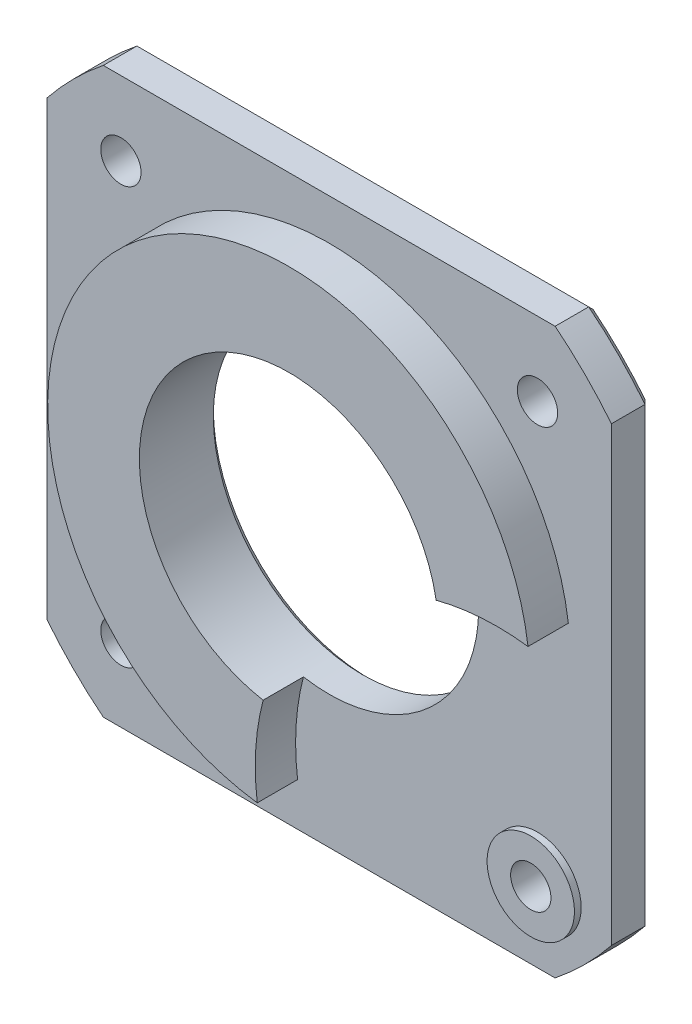
ISO-10303-21;
HEADER;
FILE_DESCRIPTION(('STEP AP214'),'2;1');
FILE_NAME('part.step','',(''),(''),'','','');
FILE_SCHEMA(('AUTOMOTIVE_DESIGN { 1 0 10303 214 1 1 1 1 }'));
ENDSEC;
DATA;
#1=APPLICATION_CONTEXT('core data for automotive mechanical design processes');
#2=APPLICATION_PROTOCOL_DEFINITION('international standard','automotive_design',2000,#1);
#3=PRODUCT_CONTEXT('',#1,'mechanical');
#4=PRODUCT('Part','Part','',(#3));
#5=PRODUCT_RELATED_PRODUCT_CATEGORY('part','',(#4));
#6=PRODUCT_DEFINITION_FORMATION('','',#4);
#7=PRODUCT_DEFINITION_CONTEXT('part definition',#1,'design');
#8=PRODUCT_DEFINITION('design','',#6,#7);
#9=PRODUCT_DEFINITION_SHAPE('','',#8);
#10=(LENGTH_UNIT() NAMED_UNIT(*) SI_UNIT(.MILLI.,.METRE.));
#11=(NAMED_UNIT(*) PLANE_ANGLE_UNIT() SI_UNIT($,.RADIAN.));
#12=(NAMED_UNIT(*) SI_UNIT($,.STERADIAN.) SOLID_ANGLE_UNIT());
#13=UNCERTAINTY_MEASURE_WITH_UNIT(LENGTH_MEASURE(1.E-05),#10,'distance_accuracy_value','');
#14=(GEOMETRIC_REPRESENTATION_CONTEXT(3) GLOBAL_UNCERTAINTY_ASSIGNED_CONTEXT((#13)) GLOBAL_UNIT_ASSIGNED_CONTEXT((#10,
#11,#12)) REPRESENTATION_CONTEXT('',''));
#15=CARTESIAN_POINT('',(0.,0.,0.));
#16=DIRECTION('',(0.,0.,1.));
#17=DIRECTION('',(1.,0.,0.));
#18=AXIS2_PLACEMENT_3D('',#15,#16,#17);
#19=CARTESIAN_POINT('',(15.5,-15.4999999999995,0.));
#20=DIRECTION('',(0.,0.,1.));
#21=DIRECTION('',(0.,-1.,0.));
#22=AXIS2_PLACEMENT_3D('',#19,#20,#21);
#23=CYLINDRICAL_SURFACE('',#22,1.5);
#24=CARTESIAN_POINT('',(15.5,-15.4999999999995,3.5));
#25=DIRECTION('',(0.,0.,-1.));
#26=DIRECTION('',(1.,0.,0.));
#27=AXIS2_PLACEMENT_3D('',#24,#25,#26);
#28=CIRCLE('',#27,1.5);
#29=CARTESIAN_POINT('',(15.5,-16.9999999999995,3.5));
#30=VERTEX_POINT('',#29);
#31=EDGE_CURVE('E27',#30,#30,#28,.T.);
#32=ORIENTED_EDGE('',*,*,#31,.F.);
#33=EDGE_LOOP('',(#32));
#34=FACE_BOUND('',#33,.T.);
#35=CARTESIAN_POINT('',(15.5,-15.4999999999995,0.5));
#36=DIRECTION('',(0.,0.,1.));
#37=DIRECTION('',(0.,-1.,0.));
#38=AXIS2_PLACEMENT_3D('',#35,#36,#37);
#39=CIRCLE('',#38,1.5);
#40=CARTESIAN_POINT('',(15.5,-16.9999999999995,0.5));
#41=VERTEX_POINT('',#40);
#42=EDGE_CURVE('E10',#41,#41,#39,.T.);
#43=ORIENTED_EDGE('',*,*,#42,.F.);
#44=EDGE_LOOP('',(#43));
#45=FACE_BOUND('',#44,.T.);
#46=ADVANCED_FACE('F16',(#34,#45),#23,.F.);
#47=CARTESIAN_POINT('',(15.5,-15.4999999999995,0.25));
#48=DIRECTION('',(0.,0.,-1.));
#49=DIRECTION('',(0.,1.,0.));
#50=AXIS2_PLACEMENT_3D('',#47,#48,#49);
#51=CONICAL_SURFACE('',#50,1.75,0.785398163397448);
#52=ORIENTED_EDGE('',*,*,#42,.T.);
#53=EDGE_LOOP('',(#52));
#54=FACE_BOUND('',#53,.T.);
#55=CARTESIAN_POINT('',(15.5,-15.4999999999995,0.));
#56=DIRECTION('',(0.,0.,1.));
#57=DIRECTION('',(0.,-1.,0.));
#58=AXIS2_PLACEMENT_3D('',#55,#56,#57);
#59=CIRCLE('',#58,2.);
#60=CARTESIAN_POINT('',(15.5,-17.4999999999995,0.));
#61=VERTEX_POINT('',#60);
#62=EDGE_CURVE('E289',#61,#61,#59,.T.);
#63=ORIENTED_EDGE('',*,*,#62,.F.);
#64=EDGE_LOOP('',(#63));
#65=FACE_BOUND('',#64,.T.);
#66=ADVANCED_FACE('F565',(#54,#65),#51,.F.);
#67=CARTESIAN_POINT('',(0.,0.,3.5));
#68=DIRECTION('',(0.,0.,1.));
#69=DIRECTION('',(1.,0.,0.));
#70=AXIS2_PLACEMENT_3D('',#67,#68,#69);
#71=PLANE('',#70);
#72=ORIENTED_EDGE('',*,*,#31,.T.);
#73=EDGE_LOOP('',(#72));
#74=FACE_BOUND('',#73,.T.);
#75=CARTESIAN_POINT('',(15.5,-15.4999999999995,3.5));
#76=DIRECTION('',(0.,0.,1.));
#77=DIRECTION('',(1.,0.,0.));
#78=AXIS2_PLACEMENT_3D('',#75,#76,#77);
#79=CIRCLE('',#78,3.25);
#80=CARTESIAN_POINT('',(18.75,-15.4999999999995,3.5));
#81=VERTEX_POINT('',#80);
#82=EDGE_CURVE('E342',#81,#81,#79,.T.);
#83=ORIENTED_EDGE('',*,*,#82,.T.);
#84=EDGE_LOOP('',(#83));
#85=FACE_BOUND('',#84,.T.);
#86=ADVANCED_FACE('F571',(#74,#85),#71,.T.);
#87=CARTESIAN_POINT('',(-15.5,15.4999999999995,0.25));
#88=DIRECTION('',(0.,0.,-1.));
#89=DIRECTION('',(0.,1.,0.));
#90=AXIS2_PLACEMENT_3D('',#87,#88,#89);
#91=CONICAL_SURFACE('',#90,1.75,0.785398163397448);
#92=CARTESIAN_POINT('',(-15.5,15.4999999999995,0.5));
#93=DIRECTION('',(0.,0.,1.));
#94=DIRECTION('',(0.,-1.,0.));
#95=AXIS2_PLACEMENT_3D('',#92,#93,#94);
#96=CIRCLE('',#95,1.5);
#97=CARTESIAN_POINT('',(-15.5,13.9999999999995,0.5));
#98=VERTEX_POINT('',#97);
#99=EDGE_CURVE('E293',#98,#98,#96,.T.);
#100=ORIENTED_EDGE('',*,*,#99,.T.);
#101=EDGE_LOOP('',(#100));
#102=FACE_BOUND('',#101,.T.);
#103=CARTESIAN_POINT('',(-15.5,15.4999999999995,0.));
#104=DIRECTION('',(0.,0.,1.));
#105=DIRECTION('',(0.,-1.,0.));
#106=AXIS2_PLACEMENT_3D('',#103,#104,#105);
#107=CIRCLE('',#106,2.);
#108=CARTESIAN_POINT('',(-15.5,13.4999999999995,0.));
#109=VERTEX_POINT('',#108);
#110=EDGE_CURVE('E295',#109,#109,#107,.T.);
#111=ORIENTED_EDGE('',*,*,#110,.F.);
#112=EDGE_LOOP('',(#111));
#113=FACE_BOUND('',#112,.T.);
#114=ADVANCED_FACE('F601',(#102,#113),#91,.F.);
#115=CARTESIAN_POINT('',(15.5,15.5,0.25));
#116=DIRECTION('',(0.,0.,-1.));
#117=DIRECTION('',(0.,1.,0.));
#118=AXIS2_PLACEMENT_3D('',#115,#116,#117);
#119=CONICAL_SURFACE('',#118,1.75,0.785398163397448);
#120=CARTESIAN_POINT('',(15.5,15.5,0.5));
#121=DIRECTION('',(0.,0.,1.));
#122=DIRECTION('',(0.,-1.,0.));
#123=AXIS2_PLACEMENT_3D('',#120,#121,#122);
#124=CIRCLE('',#123,1.5);
#125=CARTESIAN_POINT('',(15.5,14.,0.5));
#126=VERTEX_POINT('',#125);
#127=EDGE_CURVE('E290',#126,#126,#124,.T.);
#128=ORIENTED_EDGE('',*,*,#127,.T.);
#129=EDGE_LOOP('',(#128));
#130=FACE_BOUND('',#129,.T.);
#131=CARTESIAN_POINT('',(15.5,15.5,0.));
#132=DIRECTION('',(0.,0.,1.));
#133=DIRECTION('',(0.,-1.,0.));
#134=AXIS2_PLACEMENT_3D('',#131,#132,#133);
#135=CIRCLE('',#134,2.);
#136=CARTESIAN_POINT('',(15.5,13.5,0.));
#137=VERTEX_POINT('',#136);
#138=EDGE_CURVE('E285',#137,#137,#135,.T.);
#139=ORIENTED_EDGE('',*,*,#138,.F.);
#140=EDGE_LOOP('',(#139));
#141=FACE_BOUND('',#140,.T.);
#142=ADVANCED_FACE('F1057',(#130,#141),#119,.F.);
#143=CARTESIAN_POINT('',(-15.5,-15.5,0.25));
#144=DIRECTION('',(0.,0.,-1.));
#145=DIRECTION('',(0.,1.,0.));
#146=AXIS2_PLACEMENT_3D('',#143,#144,#145);
#147=CONICAL_SURFACE('',#146,1.75,0.785398163397448);
#148=CARTESIAN_POINT('',(-15.5,-15.5,0.5));
#149=DIRECTION('',(0.,0.,1.));
#150=DIRECTION('',(0.,-1.,0.));
#151=AXIS2_PLACEMENT_3D('',#148,#149,#150);
#152=CIRCLE('',#151,1.5);
#153=CARTESIAN_POINT('',(-15.5,-17.,0.5));
#154=VERTEX_POINT('',#153);
#155=EDGE_CURVE('E294',#154,#154,#152,.T.);
#156=ORIENTED_EDGE('',*,*,#155,.T.);
#157=EDGE_LOOP('',(#156));
#158=FACE_BOUND('',#157,.T.);
#159=CARTESIAN_POINT('',(-15.5,-15.5,0.));
#160=DIRECTION('',(0.,0.,1.));
#161=DIRECTION('',(0.,-1.,0.));
#162=AXIS2_PLACEMENT_3D('',#159,#160,#161);
#163=CIRCLE('',#162,2.);
#164=CARTESIAN_POINT('',(-15.5,-17.5,0.));
#165=VERTEX_POINT('',#164);
#166=EDGE_CURVE('E298',#165,#165,#163,.T.);
#167=ORIENTED_EDGE('',*,*,#166,.F.);
#168=EDGE_LOOP('',(#167));
#169=FACE_BOUND('',#168,.T.);
#170=ADVANCED_FACE('F18',(#158,#169),#147,.F.);
#171=CARTESIAN_POINT('',(-18.8110082981361,-21.,0.5));
#172=DIRECTION('',(0.,0.707106781186545,0.70710678118655));
#173=DIRECTION('',(1.,0.,0.));
#174=AXIS2_PLACEMENT_3D('',#171,#172,#173);
#175=PLANE('',#174);
#176=DIRECTION('',(1.,0.,0.));
#177=VECTOR('',#176,1.);
#178=CARTESIAN_POINT('',(-16.8110082981361,-21.,0.5));
#179=LINE('',#178,#177);
#180=CARTESIAN_POINT('',(-16.8110082981361,-21.,0.5));
#181=VERTEX_POINT('',#180);
#182=CARTESIAN_POINT('',(16.811008298136,-21.,0.5));
#183=VERTEX_POINT('',#182);
#184=EDGE_CURVE('E306',#181,#183,#179,.T.);
#185=ORIENTED_EDGE('',*,*,#184,.F.);
#186=CARTESIAN_POINT('',(-16.6346024931239,-20.4999999990436,0.));
#187=CARTESIAN_POINT('',(-16.6641480926636,-20.5833037638072,0.0833037644564176));
#188=CARTESIAN_POINT('',(-16.7230960198684,-20.7499446770065,0.249944677189171));
#189=CARTESIAN_POINT('',(-16.7817519760462,-20.9166370954188,0.416637095430405));
#190=CARTESIAN_POINT('',(-16.8110082981361,-21.,0.5));
#191=(BOUNDED_CURVE() B_SPLINE_CURVE(3,(#186,#187,#188,#189,#190),.UNSPECIFIED.,.F.,
.F.) B_SPLINE_CURVE_WITH_KNOTS((4,1,4),(-1.,-0.500022903814092,0.),
.UNSPECIFIED.) CURVE() GEOMETRIC_REPRESENTATION_ITEM() RATIONAL_B_SPLINE_CURVE((1.,1.,1.,1.,1.)) REPRESENTATION_ITEM(''));
#192=CARTESIAN_POINT('',(-16.6346024931239,-20.4999999990436,0.));
#193=VERTEX_POINT('',#192);
#194=EDGE_CURVE('E316',#193,#181,#191,.T.);
#195=ORIENTED_EDGE('',*,*,#194,.F.);
#196=DIRECTION('',(1.,0.,0.));
#197=VECTOR('',#196,1.);
#198=CARTESIAN_POINT('',(-16.6346024938999,-20.5,0.));
#199=LINE('',#198,#197);
#200=CARTESIAN_POINT('',(16.6346024931239,-20.4999999990436,0.));
#201=VERTEX_POINT('',#200);
#202=EDGE_CURVE('E282',#193,#201,#199,.T.);
#203=ORIENTED_EDGE('',*,*,#202,.T.);
#204=CARTESIAN_POINT('',(16.6346024931239,-20.4999999990436,0.));
#205=CARTESIAN_POINT('',(16.6641480926636,-20.5833037638072,0.0833037644564133));
#206=CARTESIAN_POINT('',(16.7230960198684,-20.7499446770065,0.249944677189162));
#207=CARTESIAN_POINT('',(16.7817519760462,-20.9166370954188,0.416637095430401));
#208=CARTESIAN_POINT('',(16.811008298136,-21.,0.5));
#209=(BOUNDED_CURVE() B_SPLINE_CURVE(3,(#204,#205,#206,#207,#208),.UNSPECIFIED.,.F.,
.F.) B_SPLINE_CURVE_WITH_KNOTS((4,1,4),(-1.,-0.500022903814092,0.),
.UNSPECIFIED.) CURVE() GEOMETRIC_REPRESENTATION_ITEM() RATIONAL_B_SPLINE_CURVE((1.,1.,1.,1.,1.)) REPRESENTATION_ITEM(''));
#210=EDGE_CURVE('E227',#201,#183,#209,.T.);
#211=ORIENTED_EDGE('',*,*,#210,.T.);
#212=EDGE_LOOP('',(#185,#195,#203,#211));
#213=FACE_BOUND('',#212,.T.);
#214=ADVANCED_FACE('F949',(#213),#175,.F.);
#215=CARTESIAN_POINT('',(0.,0.,0.25));
#216=DIRECTION('',(0.,0.,1.));
#217=DIRECTION('',(-0.803775640400586,-0.594932533905003,0.));
#218=AXIS2_PLACEMENT_3D('',#215,#216,#217);
#219=CONICAL_SURFACE('',#218,26.65,0.785398163397449);
#220=CARTESIAN_POINT('',(0.,0.,0.5));
#221=DIRECTION('',(0.,0.,1.));
#222=DIRECTION('',(-0.780669144981413,-0.62494454639911,0.));
#223=AXIS2_PLACEMENT_3D('',#220,#221,#222);
#224=CIRCLE('',#223,26.9);
#225=CARTESIAN_POINT('',(-21.,-16.8110082981361,0.5));
#226=VERTEX_POINT('',#225);
#227=EDGE_CURVE('E303',#226,#181,#224,.T.);
#228=ORIENTED_EDGE('',*,*,#227,.F.);
#229=CARTESIAN_POINT('',(-20.4999999990436,-16.6346024931239,0.));
#230=CARTESIAN_POINT('',(-20.5833037638072,-16.6641480926636,0.0833037644564161));
#231=CARTESIAN_POINT('',(-20.7499446770065,-16.7230960198684,0.249944677189169));
#232=CARTESIAN_POINT('',(-20.9166370954188,-16.7817519760462,0.416637095430404));
#233=CARTESIAN_POINT('',(-21.,-16.8110082981361,0.5));
#234=(BOUNDED_CURVE() B_SPLINE_CURVE(3,(#229,#230,#231,#232,#233),.UNSPECIFIED.,.F.,
.F.) B_SPLINE_CURVE_WITH_KNOTS((4,1,4),(-1.,-0.500022903814093,0.),
.UNSPECIFIED.) CURVE() GEOMETRIC_REPRESENTATION_ITEM() RATIONAL_B_SPLINE_CURVE((1.,1.,1.,1.,1.)) REPRESENTATION_ITEM(''));
#235=CARTESIAN_POINT('',(-20.4999999990436,-16.6346024931239,0.));
#236=VERTEX_POINT('',#235);
#237=EDGE_CURVE('E321',#236,#226,#234,.T.);
#238=ORIENTED_EDGE('',*,*,#237,.F.);
#239=CARTESIAN_POINT('',(0.,0.,0.));
#240=DIRECTION('',(0.,0.,1.));
#241=DIRECTION('',(-0.776515151442698,-0.630098579255598,0.));
#242=AXIS2_PLACEMENT_3D('',#239,#240,#241);
#243=CIRCLE('',#242,26.4);
#244=EDGE_CURVE('E277',#236,#193,#243,.T.);
#245=ORIENTED_EDGE('',*,*,#244,.T.);
#246=ORIENTED_EDGE('',*,*,#194,.T.);
#247=EDGE_LOOP('',(#228,#238,#245,#246));
#248=FACE_BOUND('',#247,.T.);
#249=ADVANCED_FACE('F944',(#248),#219,.T.);
#250=CARTESIAN_POINT('',(-21.,18.8110082981361,0.5));
#251=DIRECTION('',(0.707106781186548,0.,0.707106781186548));
#252=DIRECTION('',(0.,-1.,0.));
#253=AXIS2_PLACEMENT_3D('',#250,#251,#252);
#254=PLANE('',#253);
#255=DIRECTION('',(0.,-1.,0.));
#256=VECTOR('',#255,1.);
#257=CARTESIAN_POINT('',(-21.,16.8110082981361,0.5));
#258=LINE('',#257,#256);
#259=CARTESIAN_POINT('',(-21.,16.8110082981361,0.5));
#260=VERTEX_POINT('',#259);
#261=EDGE_CURVE('E271',#260,#226,#258,.T.);
#262=ORIENTED_EDGE('',*,*,#261,.F.);
#263=CARTESIAN_POINT('',(-20.4999999990436,16.6346024931238,0.));
#264=CARTESIAN_POINT('',(-20.5833037638072,16.6641480926635,0.0833037644564161));
#265=CARTESIAN_POINT('',(-20.7499446770065,16.7230960198684,0.249944677189169));
#266=CARTESIAN_POINT('',(-20.9166370954188,16.7817519760462,0.416637095430404));
#267=CARTESIAN_POINT('',(-21.,16.8110082981361,0.5));
#268=(BOUNDED_CURVE() B_SPLINE_CURVE(3,(#263,#264,#265,#266,#267),.UNSPECIFIED.,.F.,
.F.) B_SPLINE_CURVE_WITH_KNOTS((4,1,4),(-1.,-0.500022903814093,0.),
.UNSPECIFIED.) CURVE() GEOMETRIC_REPRESENTATION_ITEM() RATIONAL_B_SPLINE_CURVE((1.,1.,1.,1.,1.)) REPRESENTATION_ITEM(''));
#269=CARTESIAN_POINT('',(-20.4999999990436,16.6346024931239,0.));
#270=VERTEX_POINT('',#269);
#271=EDGE_CURVE('E331',#270,#260,#268,.T.);
#272=ORIENTED_EDGE('',*,*,#271,.F.);
#273=DIRECTION('',(0.,-1.,0.));
#274=VECTOR('',#273,1.);
#275=CARTESIAN_POINT('',(-20.5,16.6346024938999,0.));
#276=LINE('',#275,#274);
#277=EDGE_CURVE('E281',#270,#236,#276,.T.);
#278=ORIENTED_EDGE('',*,*,#277,.T.);
#279=ORIENTED_EDGE('',*,*,#237,.T.);
#280=EDGE_LOOP('',(#262,#272,#278,#279));
#281=FACE_BOUND('',#280,.T.);
#282=ADVANCED_FACE('F577',(#281),#254,.F.);
#283=CARTESIAN_POINT('',(0.,0.,0.25));
#284=DIRECTION('',(0.,0.,1.));
#285=DIRECTION('',(-0.594932533905003,0.803775640400586,0.));
#286=AXIS2_PLACEMENT_3D('',#283,#284,#285);
#287=CONICAL_SURFACE('',#286,26.65,0.785398163397454);
#288=CARTESIAN_POINT('',(0.,0.,0.5));
#289=DIRECTION('',(0.,0.,1.));
#290=DIRECTION('',(-0.62494454639911,0.780669144981413,0.));
#291=AXIS2_PLACEMENT_3D('',#288,#289,#290);
#292=CIRCLE('',#291,26.9);
#293=CARTESIAN_POINT('',(-16.8110082981361,21.,0.5));
#294=VERTEX_POINT('',#293);
#295=EDGE_CURVE('E338',#294,#260,#292,.T.);
#296=ORIENTED_EDGE('',*,*,#295,.F.);
#297=CARTESIAN_POINT('',(-16.6346024931239,20.4999999990436,0.));
#298=CARTESIAN_POINT('',(-16.6641480926636,20.5833037638072,0.0833037644564149));
#299=CARTESIAN_POINT('',(-16.7230960198684,20.7499446770065,0.249944677189165));
#300=CARTESIAN_POINT('',(-16.7817519760462,20.9166370954188,0.416637095430403));
#301=CARTESIAN_POINT('',(-16.8110082981361,21.,0.5));
#302=(BOUNDED_CURVE() B_SPLINE_CURVE(3,(#297,#298,#299,#300,#301),.UNSPECIFIED.,.F.,
.F.) B_SPLINE_CURVE_WITH_KNOTS((4,1,4),(-1.,-0.500022903814092,0.),
.UNSPECIFIED.) CURVE() GEOMETRIC_REPRESENTATION_ITEM() RATIONAL_B_SPLINE_CURVE((1.,1.,1.,1.,1.)) REPRESENTATION_ITEM(''));
#303=CARTESIAN_POINT('',(-16.6346024931239,20.4999999990436,0.));
#304=VERTEX_POINT('',#303);
#305=EDGE_CURVE('E326',#304,#294,#302,.T.);
#306=ORIENTED_EDGE('',*,*,#305,.F.);
#307=CARTESIAN_POINT('',(0.,0.,0.));
#308=DIRECTION('',(0.,0.,1.));
#309=DIRECTION('',(-0.630098579255598,0.776515151442698,0.));
#310=AXIS2_PLACEMENT_3D('',#307,#308,#309);
#311=CIRCLE('',#310,26.4);
#312=EDGE_CURVE('E370',#304,#270,#311,.T.);
#313=ORIENTED_EDGE('',*,*,#312,.T.);
#314=ORIENTED_EDGE('',*,*,#271,.T.);
#315=EDGE_LOOP('',(#296,#306,#313,#314));
#316=FACE_BOUND('',#315,.T.);
#317=ADVANCED_FACE('F594',(#316),#287,.T.);
#318=CARTESIAN_POINT('',(18.811008298136,21.,0.5));
#319=DIRECTION('',(0.,-0.707106781186545,0.70710678118655));
#320=DIRECTION('',(-1.,0.,0.));
#321=AXIS2_PLACEMENT_3D('',#318,#319,#320);
#322=PLANE('',#321);
#323=DIRECTION('',(-1.,0.,0.));
#324=VECTOR('',#323,1.);
#325=CARTESIAN_POINT('',(16.811008298136,21.,0.5));
#326=LINE('',#325,#324);
#327=CARTESIAN_POINT('',(16.811008298136,21.,0.5));
#328=VERTEX_POINT('',#327);
#329=EDGE_CURVE('E269',#328,#294,#326,.T.);
#330=ORIENTED_EDGE('',*,*,#329,.F.);
#331=CARTESIAN_POINT('',(16.6346024931239,20.4999999990436,0.));
#332=CARTESIAN_POINT('',(16.6641480926636,20.5833037638072,0.0833037644564142));
#333=CARTESIAN_POINT('',(16.7230960198684,20.7499446770065,0.249944677189164));
#334=CARTESIAN_POINT('',(16.7817519760462,20.9166370954188,0.416637095430402));
#335=CARTESIAN_POINT('',(16.811008298136,21.,0.5));
#336=(BOUNDED_CURVE() B_SPLINE_CURVE(3,(#331,#332,#333,#334,#335),.UNSPECIFIED.,.F.,
.F.) B_SPLINE_CURVE_WITH_KNOTS((4,1,4),(-1.,-0.500022903814094,0.),
.UNSPECIFIED.) CURVE() GEOMETRIC_REPRESENTATION_ITEM() RATIONAL_B_SPLINE_CURVE((1.,1.,1.,1.,1.)) REPRESENTATION_ITEM(''));
#337=CARTESIAN_POINT('',(16.6346024931239,20.4999999990436,0.));
#338=VERTEX_POINT('',#337);
#339=EDGE_CURVE('E332',#338,#328,#336,.T.);
#340=ORIENTED_EDGE('',*,*,#339,.F.);
#341=DIRECTION('',(-1.,0.,0.));
#342=VECTOR('',#341,1.);
#343=CARTESIAN_POINT('',(16.6346024938999,20.5,0.));
#344=LINE('',#343,#342);
#345=EDGE_CURVE('E315',#338,#304,#344,.T.);
#346=ORIENTED_EDGE('',*,*,#345,.T.);
#347=ORIENTED_EDGE('',*,*,#305,.T.);
#348=EDGE_LOOP('',(#330,#340,#346,#347));
#349=FACE_BOUND('',#348,.T.);
#350=ADVANCED_FACE('F513',(#349),#322,.F.);
#351=CARTESIAN_POINT('',(0.,0.,0.25));
#352=DIRECTION('',(0.,0.,1.));
#353=DIRECTION('',(0.803775640400586,0.594932533905003,0.));
#354=AXIS2_PLACEMENT_3D('',#351,#352,#353);
#355=CONICAL_SURFACE('',#354,26.65,0.785398163397449);
#356=CARTESIAN_POINT('',(0.,0.,0.5));
#357=DIRECTION('',(0.,0.,1.));
#358=DIRECTION('',(0.780669144981413,0.624944546399111,0.));
#359=AXIS2_PLACEMENT_3D('',#356,#357,#358);
#360=CIRCLE('',#359,26.9);
#361=CARTESIAN_POINT('',(21.,16.8110082981361,0.5));
#362=VERTEX_POINT('',#361);
#363=EDGE_CURVE('E270',#362,#328,#360,.T.);
#364=ORIENTED_EDGE('',*,*,#363,.F.);
#365=CARTESIAN_POINT('',(20.4999999990436,16.6346024931239,0.));
#366=CARTESIAN_POINT('',(20.5833037638072,16.6641480926636,0.0833037644564152));
#367=CARTESIAN_POINT('',(20.7499446770065,16.7230960198684,0.249944677189167));
#368=CARTESIAN_POINT('',(20.9166370954188,16.7817519760462,0.416637095430403));
#369=CARTESIAN_POINT('',(21.,16.8110082981361,0.5));
#370=(BOUNDED_CURVE() B_SPLINE_CURVE(3,(#365,#366,#367,#368,#369),.UNSPECIFIED.,.F.,
.F.) B_SPLINE_CURVE_WITH_KNOTS((4,1,4),(-1.,-0.500022903814092,0.),
.UNSPECIFIED.) CURVE() GEOMETRIC_REPRESENTATION_ITEM() RATIONAL_B_SPLINE_CURVE((1.,1.,1.,1.,1.)) REPRESENTATION_ITEM(''));
#371=CARTESIAN_POINT('',(20.4999999990436,16.6346024931239,0.));
#372=VERTEX_POINT('',#371);
#373=EDGE_CURVE('E210',#372,#362,#370,.T.);
#374=ORIENTED_EDGE('',*,*,#373,.F.);
#375=CARTESIAN_POINT('',(0.,0.,0.));
#376=DIRECTION('',(0.,0.,1.));
#377=DIRECTION('',(0.776515151442698,0.630098579255598,0.));
#378=AXIS2_PLACEMENT_3D('',#375,#376,#377);
#379=CIRCLE('',#378,26.4);
#380=EDGE_CURVE('E299',#372,#338,#379,.T.);
#381=ORIENTED_EDGE('',*,*,#380,.T.);
#382=ORIENTED_EDGE('',*,*,#339,.T.);
#383=EDGE_LOOP('',(#364,#374,#381,#382));
#384=FACE_BOUND('',#383,.T.);
#385=ADVANCED_FACE('F505',(#384),#355,.T.);
#386=CARTESIAN_POINT('',(21.,-18.8110082981361,0.5));
#387=DIRECTION('',(-0.707106781186548,0.,0.707106781186548));
#388=DIRECTION('',(0.,1.,0.));
#389=AXIS2_PLACEMENT_3D('',#386,#387,#388);
#390=PLANE('',#389);
#391=DIRECTION('',(0.,1.,0.));
#392=VECTOR('',#391,1.);
#393=CARTESIAN_POINT('',(21.,-16.8110082981361,0.5));
#394=LINE('',#393,#392);
#395=CARTESIAN_POINT('',(21.,-16.8110082981361,0.5));
#396=VERTEX_POINT('',#395);
#397=EDGE_CURVE('E230',#396,#362,#394,.T.);
#398=ORIENTED_EDGE('',*,*,#397,.F.);
#399=CARTESIAN_POINT('',(20.4999999990436,-16.6346024931239,0.));
#400=CARTESIAN_POINT('',(20.5833037638072,-16.6641480926636,0.0833037644564153));
#401=CARTESIAN_POINT('',(20.7499446770065,-16.7230960198684,0.249944677189167));
#402=CARTESIAN_POINT('',(20.9166370954188,-16.7817519760462,0.416637095430403));
#403=CARTESIAN_POINT('',(21.,-16.8110082981361,0.5));
#404=(BOUNDED_CURVE() B_SPLINE_CURVE(3,(#399,#400,#401,#402,#403),.UNSPECIFIED.,.F.,
.F.) B_SPLINE_CURVE_WITH_KNOTS((4,1,4),(-1.,-0.500022903814093,0.),
.UNSPECIFIED.) CURVE() GEOMETRIC_REPRESENTATION_ITEM() RATIONAL_B_SPLINE_CURVE((1.,1.,1.,1.,1.)) REPRESENTATION_ITEM(''));
#405=CARTESIAN_POINT('',(20.4999999990436,-16.6346024931239,0.));
#406=VERTEX_POINT('',#405);
#407=EDGE_CURVE('E219',#406,#396,#404,.T.);
#408=ORIENTED_EDGE('',*,*,#407,.F.);
#409=DIRECTION('',(0.,1.,0.));
#410=VECTOR('',#409,1.);
#411=CARTESIAN_POINT('',(20.5,-16.6346024938999,0.));
#412=LINE('',#411,#410);
#413=EDGE_CURVE('E351',#406,#372,#412,.T.);
#414=ORIENTED_EDGE('',*,*,#413,.T.);
#415=ORIENTED_EDGE('',*,*,#373,.T.);
#416=EDGE_LOOP('',(#398,#408,#414,#415));
#417=FACE_BOUND('',#416,.T.);
#418=ADVANCED_FACE('F232',(#417),#390,.F.);
#419=CARTESIAN_POINT('',(0.,0.,0.25));
#420=DIRECTION('',(0.,0.,1.));
#421=DIRECTION('',(0.594932533905003,-0.803775640400586,0.));
#422=AXIS2_PLACEMENT_3D('',#419,#420,#421);
#423=CONICAL_SURFACE('',#422,26.65,0.785398163397453);
#424=CARTESIAN_POINT('',(0.,0.,0.5));
#425=DIRECTION('',(0.,0.,1.));
#426=DIRECTION('',(0.62494454639911,-0.780669144981413,0.));
#427=AXIS2_PLACEMENT_3D('',#424,#425,#426);
#428=CIRCLE('',#427,26.9);
#429=EDGE_CURVE('E222',#183,#396,#428,.T.);
#430=ORIENTED_EDGE('',*,*,#429,.F.);
#431=ORIENTED_EDGE('',*,*,#210,.F.);
#432=CARTESIAN_POINT('',(0.,0.,0.));
#433=DIRECTION('',(0.,0.,1.));
#434=DIRECTION('',(0.630098579255598,-0.776515151442698,0.));
#435=AXIS2_PLACEMENT_3D('',#432,#433,#434);
#436=CIRCLE('',#435,26.4);
#437=EDGE_CURVE('E224',#201,#406,#436,.T.);
#438=ORIENTED_EDGE('',*,*,#437,.T.);
#439=ORIENTED_EDGE('',*,*,#407,.T.);
#440=EDGE_LOOP('',(#430,#431,#438,#439));
#441=FACE_BOUND('',#440,.T.);
#442=ADVANCED_FACE('F220',(#441),#423,.T.);
#443=CARTESIAN_POINT('',(0.,0.,0.));
#444=DIRECTION('',(0.,0.,1.));
#445=DIRECTION('',(1.,0.,0.));
#446=AXIS2_PLACEMENT_3D('',#443,#444,#445);
#447=PLANE('',#446);
#448=ORIENTED_EDGE('',*,*,#138,.T.);
#449=EDGE_LOOP('',(#448));
#450=FACE_BOUND('',#449,.T.);
#451=ORIENTED_EDGE('',*,*,#62,.T.);
#452=EDGE_LOOP('',(#451));
#453=FACE_BOUND('',#452,.T.);
#454=CARTESIAN_POINT('',(0.,0.,0.));
#455=DIRECTION('',(0.,0.,1.));
#456=DIRECTION('',(1.,0.,0.));
#457=AXIS2_PLACEMENT_3D('',#454,#455,#456);
#458=CIRCLE('',#457,11.625);
#459=CARTESIAN_POINT('',(11.625,0.,0.));
#460=VERTEX_POINT('',#459);
#461=EDGE_CURVE('E253',#460,#460,#458,.T.);
#462=ORIENTED_EDGE('',*,*,#461,.T.);
#463=EDGE_LOOP('',(#462));
#464=FACE_BOUND('',#463,.T.);
#465=ORIENTED_EDGE('',*,*,#166,.T.);
#466=EDGE_LOOP('',(#465));
#467=FACE_BOUND('',#466,.T.);
#468=ORIENTED_EDGE('',*,*,#110,.T.);
#469=EDGE_LOOP('',(#468));
#470=FACE_BOUND('',#469,.T.);
#471=ORIENTED_EDGE('',*,*,#413,.F.);
#472=ORIENTED_EDGE('',*,*,#437,.F.);
#473=ORIENTED_EDGE('',*,*,#202,.F.);
#474=ORIENTED_EDGE('',*,*,#244,.F.);
#475=ORIENTED_EDGE('',*,*,#277,.F.);
#476=ORIENTED_EDGE('',*,*,#312,.F.);
#477=ORIENTED_EDGE('',*,*,#345,.F.);
#478=ORIENTED_EDGE('',*,*,#380,.F.);
#479=EDGE_LOOP('',(#471,#472,#473,#474,#475,#476,#477,#478));
#480=FACE_BOUND('',#479,.T.);
#481=ADVANCED_FACE('F509',(#450,#453,#464,#467,#470,#480),#447,.F.);
#482=CARTESIAN_POINT('',(15.5,-15.4999999999995,3.));
#483=DIRECTION('',(0.,0.,1.));
#484=DIRECTION('',(1.,0.,0.));
#485=AXIS2_PLACEMENT_3D('',#482,#483,#484);
#486=CYLINDRICAL_SURFACE('',#485,3.25);
#487=ORIENTED_EDGE('',*,*,#82,.F.);
#488=EDGE_LOOP('',(#487));
#489=FACE_BOUND('',#488,.T.);
#490=CARTESIAN_POINT('',(15.5,-15.4999999999995,3.));
#491=DIRECTION('',(0.,0.,1.));
#492=DIRECTION('',(1.,0.,0.));
#493=AXIS2_PLACEMENT_3D('',#490,#491,#492);
#494=CIRCLE('',#493,3.25);
#495=CARTESIAN_POINT('',(18.75,-15.4999999999995,3.));
#496=VERTEX_POINT('',#495);
#497=EDGE_CURVE('E90',#496,#496,#494,.T.);
#498=ORIENTED_EDGE('',*,*,#497,.T.);
#499=EDGE_LOOP('',(#498));
#500=FACE_BOUND('',#499,.T.);
#501=ADVANCED_FACE('F850',(#489,#500),#486,.T.);
#502=CARTESIAN_POINT('',(-15.5,15.4999999999995,0.));
#503=DIRECTION('',(0.,0.,1.));
#504=DIRECTION('',(0.,-1.,0.));
#505=AXIS2_PLACEMENT_3D('',#502,#503,#504);
#506=CYLINDRICAL_SURFACE('',#505,1.5);
#507=CARTESIAN_POINT('',(-15.5,15.4999999999995,3.));
#508=DIRECTION('',(0.,0.,-1.));
#509=DIRECTION('',(0.,-1.,0.));
#510=AXIS2_PLACEMENT_3D('',#507,#508,#509);
#511=CIRCLE('',#510,1.5);
#512=CARTESIAN_POINT('',(-15.5,13.9999999999995,3.));
#513=VERTEX_POINT('',#512);
#514=EDGE_CURVE('E100',#513,#513,#511,.T.);
#515=ORIENTED_EDGE('',*,*,#514,.F.);
#516=EDGE_LOOP('',(#515));
#517=FACE_BOUND('',#516,.T.);
#518=ORIENTED_EDGE('',*,*,#99,.F.);
#519=EDGE_LOOP('',(#518));
#520=FACE_BOUND('',#519,.T.);
#521=ADVANCED_FACE('F843',(#517,#520),#506,.F.);
#522=CARTESIAN_POINT('',(15.5,15.5,0.));
#523=DIRECTION('',(0.,0.,1.));
#524=DIRECTION('',(0.,-1.,0.));
#525=AXIS2_PLACEMENT_3D('',#522,#523,#524);
#526=CYLINDRICAL_SURFACE('',#525,1.5);
#527=CARTESIAN_POINT('',(15.5,15.5,3.));
#528=DIRECTION('',(0.,0.,-1.));
#529=DIRECTION('',(0.,-1.,0.));
#530=AXIS2_PLACEMENT_3D('',#527,#528,#529);
#531=CIRCLE('',#530,1.5);
#532=CARTESIAN_POINT('',(15.5,14.,3.));
#533=VERTEX_POINT('',#532);
#534=EDGE_CURVE('E360',#533,#533,#531,.T.);
#535=ORIENTED_EDGE('',*,*,#534,.F.);
#536=EDGE_LOOP('',(#535));
#537=FACE_BOUND('',#536,.T.);
#538=ORIENTED_EDGE('',*,*,#127,.F.);
#539=EDGE_LOOP('',(#538));
#540=FACE_BOUND('',#539,.T.);
#541=ADVANCED_FACE('F849',(#537,#540),#526,.F.);
#542=CARTESIAN_POINT('',(-15.5,-15.5,0.));
#543=DIRECTION('',(0.,0.,1.));
#544=DIRECTION('',(0.,-1.,0.));
#545=AXIS2_PLACEMENT_3D('',#542,#543,#544);
#546=CYLINDRICAL_SURFACE('',#545,1.5);
#547=CARTESIAN_POINT('',(-15.5,-15.5,3.));
#548=DIRECTION('',(0.,0.,-1.));
#549=DIRECTION('',(0.,-1.,0.));
#550=AXIS2_PLACEMENT_3D('',#547,#548,#549);
#551=CIRCLE('',#550,1.5);
#552=CARTESIAN_POINT('',(-15.5,-17.,3.));
#553=VERTEX_POINT('',#552);
#554=EDGE_CURVE('E419',#553,#553,#551,.T.);
#555=ORIENTED_EDGE('',*,*,#554,.F.);
#556=EDGE_LOOP('',(#555));
#557=FACE_BOUND('',#556,.T.);
#558=ORIENTED_EDGE('',*,*,#155,.F.);
#559=EDGE_LOOP('',(#558));
#560=FACE_BOUND('',#559,.T.);
#561=ADVANCED_FACE('F592',(#557,#560),#546,.F.);
#562=CARTESIAN_POINT('',(-16.8110082981361,-21.,0.));
#563=DIRECTION('',(0.,-1.,0.));
#564=DIRECTION('',(0.,0.,-1.));
#565=AXIS2_PLACEMENT_3D('',#562,#563,#564);
#566=PLANE('',#565);
#567=ORIENTED_EDGE('',*,*,#184,.T.);
#568=DIRECTION('',(0.,0.,1.));
#569=VECTOR('',#568,1.);
#570=CARTESIAN_POINT('',(16.811008298136,-21.,0.5));
#571=LINE('',#570,#569);
#572=CARTESIAN_POINT('',(16.8110082981361,-21.,3.));
#573=VERTEX_POINT('',#572);
#574=EDGE_CURVE('E237',#183,#573,#571,.T.);
#575=ORIENTED_EDGE('',*,*,#574,.T.);
#576=DIRECTION('',(1.,0.,0.));
#577=VECTOR('',#576,1.);
#578=CARTESIAN_POINT('',(-16.8110082981361,-21.,3.));
#579=LINE('',#578,#577);
#580=CARTESIAN_POINT('',(-16.8110082981361,-21.,3.));
#581=VERTEX_POINT('',#580);
#582=EDGE_CURVE('E263',#581,#573,#579,.T.);
#583=ORIENTED_EDGE('',*,*,#582,.F.);
#584=DIRECTION('',(0.,0.,1.));
#585=VECTOR('',#584,1.);
#586=CARTESIAN_POINT('',(-16.8110082981361,-21.,0.5));
#587=LINE('',#586,#585);
#588=EDGE_CURVE('E418',#181,#581,#587,.T.);
#589=ORIENTED_EDGE('',*,*,#588,.F.);
#590=EDGE_LOOP('',(#567,#575,#583,#589));
#591=FACE_BOUND('',#590,.T.);
#592=ADVANCED_FACE('F588',(#591),#566,.T.);
#593=CARTESIAN_POINT('',(0.,0.,0.));
#594=DIRECTION('',(0.,0.,1.));
#595=DIRECTION('',(-0.780669144981413,-0.62494454639911,0.));
#596=AXIS2_PLACEMENT_3D('',#593,#594,#595);
#597=CYLINDRICAL_SURFACE('',#596,26.9);
#598=ORIENTED_EDGE('',*,*,#227,.T.);
#599=ORIENTED_EDGE('',*,*,#588,.T.);
#600=CARTESIAN_POINT('',(0.,0.,3.));
#601=DIRECTION('',(0.,0.,1.));
#602=DIRECTION('',(-0.780669144981413,-0.62494454639911,0.));
#603=AXIS2_PLACEMENT_3D('',#600,#601,#602);
#604=CIRCLE('',#603,26.9);
#605=CARTESIAN_POINT('',(-21.,-16.8110082981361,3.));
#606=VERTEX_POINT('',#605);
#607=EDGE_CURVE('E435',#606,#581,#604,.T.);
#608=ORIENTED_EDGE('',*,*,#607,.F.);
#609=DIRECTION('',(0.,0.,1.));
#610=VECTOR('',#609,1.);
#611=CARTESIAN_POINT('',(-21.,-16.8110082981361,0.5));
#612=LINE('',#611,#610);
#613=EDGE_CURVE('E275',#226,#606,#612,.T.);
#614=ORIENTED_EDGE('',*,*,#613,.F.);
#615=EDGE_LOOP('',(#598,#599,#608,#614));
#616=FACE_BOUND('',#615,.T.);
#617=ADVANCED_FACE('F591',(#616),#597,.T.);
#618=CARTESIAN_POINT('',(-21.,16.8110082981361,0.));
#619=DIRECTION('',(-1.,0.,0.));
#620=DIRECTION('',(0.,0.,1.));
#621=AXIS2_PLACEMENT_3D('',#618,#619,#620);
#622=PLANE('',#621);
#623=ORIENTED_EDGE('',*,*,#261,.T.);
#624=ORIENTED_EDGE('',*,*,#613,.T.);
#625=DIRECTION('',(0.,-1.,0.));
#626=VECTOR('',#625,1.);
#627=CARTESIAN_POINT('',(-21.,16.8110082981361,3.));
#628=LINE('',#627,#626);
#629=CARTESIAN_POINT('',(-21.,16.8110082981361,3.));
#630=VERTEX_POINT('',#629);
#631=EDGE_CURVE('E356',#630,#606,#628,.T.);
#632=ORIENTED_EDGE('',*,*,#631,.F.);
#633=DIRECTION('',(0.,0.,1.));
#634=VECTOR('',#633,1.);
#635=CARTESIAN_POINT('',(-21.,16.8110082981361,0.5));
#636=LINE('',#635,#634);
#637=EDGE_CURVE('E276',#260,#630,#636,.T.);
#638=ORIENTED_EDGE('',*,*,#637,.F.);
#639=EDGE_LOOP('',(#623,#624,#632,#638));
#640=FACE_BOUND('',#639,.T.);
#641=ADVANCED_FACE('F603',(#640),#622,.T.);
#642=CARTESIAN_POINT('',(0.,0.,0.));
#643=DIRECTION('',(0.,0.,1.));
#644=DIRECTION('',(-0.624944546399111,0.780669144981413,0.));
#645=AXIS2_PLACEMENT_3D('',#642,#643,#644);
#646=CYLINDRICAL_SURFACE('',#645,26.9);
#647=ORIENTED_EDGE('',*,*,#295,.T.);
#648=ORIENTED_EDGE('',*,*,#637,.T.);
#649=CARTESIAN_POINT('',(0.,0.,3.));
#650=DIRECTION('',(0.,0.,1.));
#651=DIRECTION('',(-0.624944546399111,0.780669144981413,0.));
#652=AXIS2_PLACEMENT_3D('',#649,#650,#651);
#653=CIRCLE('',#652,26.9);
#654=CARTESIAN_POINT('',(-16.8110082981361,21.,3.));
#655=VERTEX_POINT('',#654);
#656=EDGE_CURVE('E352',#655,#630,#653,.T.);
#657=ORIENTED_EDGE('',*,*,#656,.F.);
#658=DIRECTION('',(0.,0.,1.));
#659=VECTOR('',#658,1.);
#660=CARTESIAN_POINT('',(-16.8110082981361,21.,0.5));
#661=LINE('',#660,#659);
#662=EDGE_CURVE('E345',#294,#655,#661,.T.);
#663=ORIENTED_EDGE('',*,*,#662,.F.);
#664=EDGE_LOOP('',(#647,#648,#657,#663));
#665=FACE_BOUND('',#664,.T.);
#666=ADVANCED_FACE('F586',(#665),#646,.T.);
#667=CARTESIAN_POINT('',(16.811008298136,21.,0.));
#668=DIRECTION('',(0.,1.,0.));
#669=DIRECTION('',(1.,0.,0.));
#670=AXIS2_PLACEMENT_3D('',#667,#668,#669);
#671=PLANE('',#670);
#672=ORIENTED_EDGE('',*,*,#329,.T.);
#673=ORIENTED_EDGE('',*,*,#662,.T.);
#674=DIRECTION('',(-1.,0.,0.));
#675=VECTOR('',#674,1.);
#676=CARTESIAN_POINT('',(16.811008298136,21.,3.));
#677=LINE('',#676,#675);
#678=CARTESIAN_POINT('',(16.811008298136,21.,3.));
#679=VERTEX_POINT('',#678);
#680=EDGE_CURVE('E357',#679,#655,#677,.T.);
#681=ORIENTED_EDGE('',*,*,#680,.F.);
#682=DIRECTION('',(0.,0.,1.));
#683=VECTOR('',#682,1.);
#684=CARTESIAN_POINT('',(16.811008298136,21.,0.5));
#685=LINE('',#684,#683);
#686=EDGE_CURVE('E265',#328,#679,#685,.T.);
#687=ORIENTED_EDGE('',*,*,#686,.F.);
#688=EDGE_LOOP('',(#672,#673,#681,#687));
#689=FACE_BOUND('',#688,.T.);
#690=ADVANCED_FACE('F583',(#689),#671,.T.);
#691=CARTESIAN_POINT('',(0.,0.,0.));
#692=DIRECTION('',(0.,0.,1.));
#693=DIRECTION('',(0.780669144981413,0.624944546399111,0.));
#694=AXIS2_PLACEMENT_3D('',#691,#692,#693);
#695=CYLINDRICAL_SURFACE('',#694,26.9);
#696=ORIENTED_EDGE('',*,*,#363,.T.);
#697=ORIENTED_EDGE('',*,*,#686,.T.);
#698=CARTESIAN_POINT('',(0.,0.,3.));
#699=DIRECTION('',(0.,0.,1.));
#700=DIRECTION('',(0.780669144981413,0.624944546399111,0.));
#701=AXIS2_PLACEMENT_3D('',#698,#699,#700);
#702=CIRCLE('',#701,26.9);
#703=CARTESIAN_POINT('',(21.,16.8110082981361,3.));
#704=VERTEX_POINT('',#703);
#705=EDGE_CURVE('E469',#704,#679,#702,.T.);
#706=ORIENTED_EDGE('',*,*,#705,.F.);
#707=DIRECTION('',(0.,0.,1.));
#708=VECTOR('',#707,1.);
#709=CARTESIAN_POINT('',(21.,16.8110082981361,0.5));
#710=LINE('',#709,#708);
#711=EDGE_CURVE('E236',#362,#704,#710,.T.);
#712=ORIENTED_EDGE('',*,*,#711,.F.);
#713=EDGE_LOOP('',(#696,#697,#706,#712));
#714=FACE_BOUND('',#713,.T.);
#715=ADVANCED_FACE('F500',(#714),#695,.T.);
#716=CARTESIAN_POINT('',(21.,-16.8110082981361,0.));
#717=DIRECTION('',(1.,0.,0.));
#718=DIRECTION('',(0.,1.,0.));
#719=AXIS2_PLACEMENT_3D('',#716,#717,#718);
#720=PLANE('',#719);
#721=ORIENTED_EDGE('',*,*,#397,.T.);
#722=ORIENTED_EDGE('',*,*,#711,.T.);
#723=DIRECTION('',(0.,1.,0.));
#724=VECTOR('',#723,1.);
#725=CARTESIAN_POINT('',(21.,-16.8110082981361,3.));
#726=LINE('',#725,#724);
#727=CARTESIAN_POINT('',(21.,-16.8110082981361,3.));
#728=VERTEX_POINT('',#727);
#729=EDGE_CURVE('E243',#728,#704,#726,.T.);
#730=ORIENTED_EDGE('',*,*,#729,.F.);
#731=DIRECTION('',(0.,0.,1.));
#732=VECTOR('',#731,1.);
#733=CARTESIAN_POINT('',(21.,-16.8110082981361,0.5));
#734=LINE('',#733,#732);
#735=EDGE_CURVE('E240',#396,#728,#734,.T.);
#736=ORIENTED_EDGE('',*,*,#735,.F.);
#737=EDGE_LOOP('',(#721,#722,#730,#736));
#738=FACE_BOUND('',#737,.T.);
#739=ADVANCED_FACE('F241',(#738),#720,.T.);
#740=CARTESIAN_POINT('',(0.,0.,0.));
#741=DIRECTION('',(0.,0.,1.));
#742=DIRECTION('',(0.62494454639911,-0.780669144981413,0.));
#743=AXIS2_PLACEMENT_3D('',#740,#741,#742);
#744=CYLINDRICAL_SURFACE('',#743,26.9);
#745=ORIENTED_EDGE('',*,*,#429,.T.);
#746=ORIENTED_EDGE('',*,*,#735,.T.);
#747=CARTESIAN_POINT('',(0.,0.,3.));
#748=DIRECTION('',(0.,0.,1.));
#749=DIRECTION('',(0.62494454639911,-0.780669144981413,0.));
#750=AXIS2_PLACEMENT_3D('',#747,#748,#749);
#751=CIRCLE('',#750,26.9);
#752=EDGE_CURVE('E380',#573,#728,#751,.T.);
#753=ORIENTED_EDGE('',*,*,#752,.F.);
#754=ORIENTED_EDGE('',*,*,#574,.F.);
#755=EDGE_LOOP('',(#745,#746,#753,#754));
#756=FACE_BOUND('',#755,.T.);
#757=ADVANCED_FACE('F250',(#756),#744,.T.);
#758=CARTESIAN_POINT('',(0.,0.,6.));
#759=DIRECTION('',(0.,0.,1.));
#760=DIRECTION('',(1.,0.,0.));
#761=AXIS2_PLACEMENT_3D('',#758,#759,#760);
#762=PLANE('',#761);
#763=CARTESIAN_POINT('',(15.5,-15.4999999999997,6.));
#764=DIRECTION('',(0.,0.,-1.));
#765=DIRECTION('',(-0.252306781917478,0.967647295143456,0.));
#766=AXIS2_PLACEMENT_3D('',#763,#764,#765);
#767=CIRCLE('',#766,18.);
#768=CARTESIAN_POINT('',(10.9584779254854,1.91765131258265,6.));
#769=VERTEX_POINT('',#768);
#770=CARTESIAN_POINT('',(17.7950978232822,2.35308169425048,6.));
#771=VERTEX_POINT('',#770);
#772=EDGE_CURVE('E20',#769,#771,#767,.T.);
#773=ORIENTED_EDGE('',*,*,#772,.T.);
#774=CARTESIAN_POINT('',(0.,0.,6.));
#775=DIRECTION('',(0.,0.,1.));
#776=DIRECTION('',(0.991370352271989,0.131090902186656,0.));
#777=AXIS2_PLACEMENT_3D('',#774,#775,#776);
#778=CIRCLE('',#777,17.95);
#779=CARTESIAN_POINT('',(-2.35308169424996,-17.7950978232823,6.));
#780=VERTEX_POINT('',#779);
#781=EDGE_CURVE('E364',#771,#780,#778,.T.);
#782=ORIENTED_EDGE('',*,*,#781,.T.);
#783=CARTESIAN_POINT('',(15.5,-15.4999999999996,6.));
#784=DIRECTION('',(0.,0.,-1.));
#785=DIRECTION('',(-0.991837871902776,-0.127505434626816,0.));
#786=AXIS2_PLACEMENT_3D('',#783,#784,#785);
#787=CIRCLE('',#786,18.);
#788=CARTESIAN_POINT('',(-1.91765131258233,-10.9584779254854,6.));
#789=VERTEX_POINT('',#788);
#790=EDGE_CURVE('E307',#780,#789,#787,.T.);
#791=ORIENTED_EDGE('',*,*,#790,.T.);
#792=CARTESIAN_POINT('',(0.,0.,6.));
#793=DIRECTION('',(0.,0.,-1.));
#794=DIRECTION('',(-0.172373151692794,-0.985031723639139,0.));
#795=AXIS2_PLACEMENT_3D('',#792,#793,#794);
#796=CIRCLE('',#795,11.125);
#797=EDGE_CURVE('E375',#789,#769,#796,.T.);
#798=ORIENTED_EDGE('',*,*,#797,.T.);
#799=EDGE_LOOP('',(#773,#782,#791,#798));
#800=FACE_BOUND('',#799,.T.);
#801=ADVANCED_FACE('F547',(#800),#762,.T.);
#802=CARTESIAN_POINT('',(0.,0.,0.25));
#803=DIRECTION('',(0.,0.,-1.));
#804=DIRECTION('',(-1.,0.,0.));
#805=AXIS2_PLACEMENT_3D('',#802,#803,#804);
#806=CONICAL_SURFACE('',#805,11.375,0.785398163397448);
#807=ORIENTED_EDGE('',*,*,#461,.F.);
#808=EDGE_LOOP('',(#807));
#809=FACE_BOUND('',#808,.T.);
#810=CARTESIAN_POINT('',(0.,0.,0.5));
#811=DIRECTION('',(0.,0.,1.));
#812=DIRECTION('',(1.,0.,0.));
#813=AXIS2_PLACEMENT_3D('',#810,#811,#812);
#814=CIRCLE('',#813,11.125);
#815=CARTESIAN_POINT('',(11.125,0.,0.5));
#816=VERTEX_POINT('',#815);
#817=EDGE_CURVE('E466',#816,#816,#814,.T.);
#818=ORIENTED_EDGE('',*,*,#817,.T.);
#819=EDGE_LOOP('',(#818));
#820=FACE_BOUND('',#819,.T.);
#821=ADVANCED_FACE('F543',(#809,#820),#806,.F.);
#822=CARTESIAN_POINT('',(15.5,-15.4999999999997,3.));
#823=DIRECTION('',(0.,0.,-1.));
#824=DIRECTION('',(-0.252306781917478,0.967647295143456,0.));
#825=AXIS2_PLACEMENT_3D('',#822,#823,#824);
#826=CYLINDRICAL_SURFACE('',#825,18.);
#827=CARTESIAN_POINT('',(15.5,-15.4999999999997,3.));
#828=DIRECTION('',(0.,0.,-1.));
#829=DIRECTION('',(-0.252306781917478,0.967647295143456,0.));
#830=AXIS2_PLACEMENT_3D('',#827,#828,#829);
#831=CIRCLE('',#830,18.);
#832=CARTESIAN_POINT('',(10.9584779254854,1.91765131258265,3.));
#833=VERTEX_POINT('',#832);
#834=CARTESIAN_POINT('',(17.7950978232822,2.35308169425048,3.));
#835=VERTEX_POINT('',#834);
#836=EDGE_CURVE('E192',#833,#835,#831,.T.);
#837=ORIENTED_EDGE('',*,*,#836,.T.);
#838=DIRECTION('',(0.,0.,1.));
#839=VECTOR('',#838,1.);
#840=CARTESIAN_POINT('',(17.7950978232822,2.35308169425048,3.));
#841=LINE('',#840,#839);
#842=EDGE_CURVE('E410',#835,#771,#841,.T.);
#843=ORIENTED_EDGE('',*,*,#842,.T.);
#844=ORIENTED_EDGE('',*,*,#772,.F.);
#845=DIRECTION('',(0.,0.,1.));
#846=VECTOR('',#845,1.);
#847=CARTESIAN_POINT('',(10.9584779254854,1.91765131258264,3.));
#848=LINE('',#847,#846);
#849=EDGE_CURVE('E389',#833,#769,#848,.T.);
#850=ORIENTED_EDGE('',*,*,#849,.F.);
#851=EDGE_LOOP('',(#837,#843,#844,#850));
#852=FACE_BOUND('',#851,.T.);
#853=ADVANCED_FACE('F546',(#852),#826,.F.);
#854=CARTESIAN_POINT('',(0.,0.,3.));
#855=DIRECTION('',(0.,0.,1.));
#856=DIRECTION('',(0.991370352271989,0.131090902186656,0.));
#857=AXIS2_PLACEMENT_3D('',#854,#855,#856);
#858=CYLINDRICAL_SURFACE('',#857,17.95);
#859=CARTESIAN_POINT('',(0.,0.,3.));
#860=DIRECTION('',(0.,0.,1.));
#861=DIRECTION('',(0.991370352271989,0.131090902186656,0.));
#862=AXIS2_PLACEMENT_3D('',#859,#860,#861);
#863=CIRCLE('',#862,17.95);
#864=CARTESIAN_POINT('',(-2.35308169424996,-17.7950978232823,3.));
#865=VERTEX_POINT('',#864);
#866=EDGE_CURVE('E422',#835,#865,#863,.T.);
#867=ORIENTED_EDGE('',*,*,#866,.T.);
#868=DIRECTION('',(0.,0.,1.));
#869=VECTOR('',#868,1.);
#870=CARTESIAN_POINT('',(-2.35308169424996,-17.7950978232823,3.));
#871=LINE('',#870,#869);
#872=EDGE_CURVE('E311',#865,#780,#871,.T.);
#873=ORIENTED_EDGE('',*,*,#872,.T.);
#874=ORIENTED_EDGE('',*,*,#781,.F.);
#875=ORIENTED_EDGE('',*,*,#842,.F.);
#876=EDGE_LOOP('',(#867,#873,#874,#875));
#877=FACE_BOUND('',#876,.T.);
#878=ADVANCED_FACE('F581',(#877),#858,.T.);
#879=CARTESIAN_POINT('',(15.5,-15.4999999999996,3.));
#880=DIRECTION('',(0.,0.,-1.));
#881=DIRECTION('',(-0.991837871902776,-0.127505434626816,0.));
#882=AXIS2_PLACEMENT_3D('',#879,#880,#881);
#883=CYLINDRICAL_SURFACE('',#882,18.);
#884=CARTESIAN_POINT('',(15.5,-15.4999999999996,3.));
#885=DIRECTION('',(0.,0.,-1.));
#886=DIRECTION('',(-0.991837871902776,-0.127505434626816,0.));
#887=AXIS2_PLACEMENT_3D('',#884,#885,#886);
#888=CIRCLE('',#887,18.);
#889=CARTESIAN_POINT('',(-1.91765131258233,-10.9584779254854,3.));
#890=VERTEX_POINT('',#889);
#891=EDGE_CURVE('E426',#865,#890,#888,.T.);
#892=ORIENTED_EDGE('',*,*,#891,.T.);
#893=DIRECTION('',(0.,0.,1.));
#894=VECTOR('',#893,1.);
#895=CARTESIAN_POINT('',(-1.91765131258233,-10.9584779254854,3.));
#896=LINE('',#895,#894);
#897=EDGE_CURVE('E371',#890,#789,#896,.T.);
#898=ORIENTED_EDGE('',*,*,#897,.T.);
#899=ORIENTED_EDGE('',*,*,#790,.F.);
#900=ORIENTED_EDGE('',*,*,#872,.F.);
#901=EDGE_LOOP('',(#892,#898,#899,#900));
#902=FACE_BOUND('',#901,.T.);
#903=ADVANCED_FACE('F559',(#902),#883,.F.);
#904=CARTESIAN_POINT('',(0.,0.,3.));
#905=DIRECTION('',(0.,0.,1.));
#906=DIRECTION('',(1.,0.,0.));
#907=AXIS2_PLACEMENT_3D('',#904,#905,#906);
#908=PLANE('',#907);
#909=ORIENTED_EDGE('',*,*,#497,.F.);
#910=EDGE_LOOP('',(#909));
#911=FACE_BOUND('',#910,.T.);
#912=ORIENTED_EDGE('',*,*,#514,.T.);
#913=EDGE_LOOP('',(#912));
#914=FACE_BOUND('',#913,.T.);
#915=ORIENTED_EDGE('',*,*,#534,.T.);
#916=EDGE_LOOP('',(#915));
#917=FACE_BOUND('',#916,.T.);
#918=ORIENTED_EDGE('',*,*,#554,.T.);
#919=EDGE_LOOP('',(#918));
#920=FACE_BOUND('',#919,.T.);
#921=ORIENTED_EDGE('',*,*,#836,.F.);
#922=CARTESIAN_POINT('',(0.,0.,3.));
#923=DIRECTION('',(0.,0.,-1.));
#924=DIRECTION('',(1.,0.,0.));
#925=AXIS2_PLACEMENT_3D('',#922,#923,#924);
#926=CIRCLE('',#925,11.125);
#927=CARTESIAN_POINT('',(11.125,0.,3.));
#928=VERTEX_POINT('',#927);
#929=EDGE_CURVE('E460',#833,#928,#926,.T.);
#930=ORIENTED_EDGE('',*,*,#929,.T.);
#931=CARTESIAN_POINT('',(0.,0.,3.));
#932=DIRECTION('',(0.,0.,-1.));
#933=DIRECTION('',(-0.172373151692794,-0.985031723639139,0.));
#934=AXIS2_PLACEMENT_3D('',#931,#932,#933);
#935=CIRCLE('',#934,11.125);
#936=EDGE_CURVE('E178',#928,#890,#935,.T.);
#937=ORIENTED_EDGE('',*,*,#936,.T.);
#938=ORIENTED_EDGE('',*,*,#891,.F.);
#939=ORIENTED_EDGE('',*,*,#866,.F.);
#940=EDGE_LOOP('',(#921,#930,#937,#938,#939));
#941=FACE_BOUND('',#940,.T.);
#942=ORIENTED_EDGE('',*,*,#752,.T.);
#943=ORIENTED_EDGE('',*,*,#729,.T.);
#944=ORIENTED_EDGE('',*,*,#705,.T.);
#945=ORIENTED_EDGE('',*,*,#680,.T.);
#946=ORIENTED_EDGE('',*,*,#656,.T.);
#947=ORIENTED_EDGE('',*,*,#631,.T.);
#948=ORIENTED_EDGE('',*,*,#607,.T.);
#949=ORIENTED_EDGE('',*,*,#582,.T.);
#950=EDGE_LOOP('',(#942,#943,#944,#945,#946,#947,#948,#949));
#951=FACE_BOUND('',#950,.T.);
#952=ADVANCED_FACE('F553',(#911,#914,#917,#920,#941,#951),#908,.T.);
#953=CARTESIAN_POINT('',(0.,0.,0.));
#954=DIRECTION('',(0.,0.,1.));
#955=DIRECTION('',(1.,0.,0.));
#956=AXIS2_PLACEMENT_3D('',#953,#954,#955);
#957=CYLINDRICAL_SURFACE('',#956,11.125);
#958=ORIENTED_EDGE('',*,*,#929,.F.);
#959=ORIENTED_EDGE('',*,*,#849,.T.);
#960=ORIENTED_EDGE('',*,*,#797,.F.);
#961=ORIENTED_EDGE('',*,*,#897,.F.);
#962=ORIENTED_EDGE('',*,*,#936,.F.);
#963=EDGE_LOOP('',(#958,#959,#960,#961,#962));
#964=FACE_BOUND('',#963,.T.);
#965=ORIENTED_EDGE('',*,*,#817,.F.);
#966=EDGE_LOOP('',(#965));
#967=FACE_BOUND('',#966,.T.);
#968=ADVANCED_FACE('F551',(#964,#967),#957,.F.);
#969=CLOSED_SHELL('',(#46,#66,#86,#114,#142,#170,#214,#249,#282,#317,#350,#385,#418,#442,#481,
#501,#521,#541,#561,#592,#617,#641,#666,#690,#715,#739,#757,#801,#821,#853,#878,#903,#952,#968));
#970=MANIFOLD_SOLID_BREP('B1',#969);
#971=ADVANCED_BREP_SHAPE_REPRESENTATION('',(#18,#970),#14);
#972=SHAPE_DEFINITION_REPRESENTATION(#9,#971);
ENDSEC;
END-ISO-10303-21;
